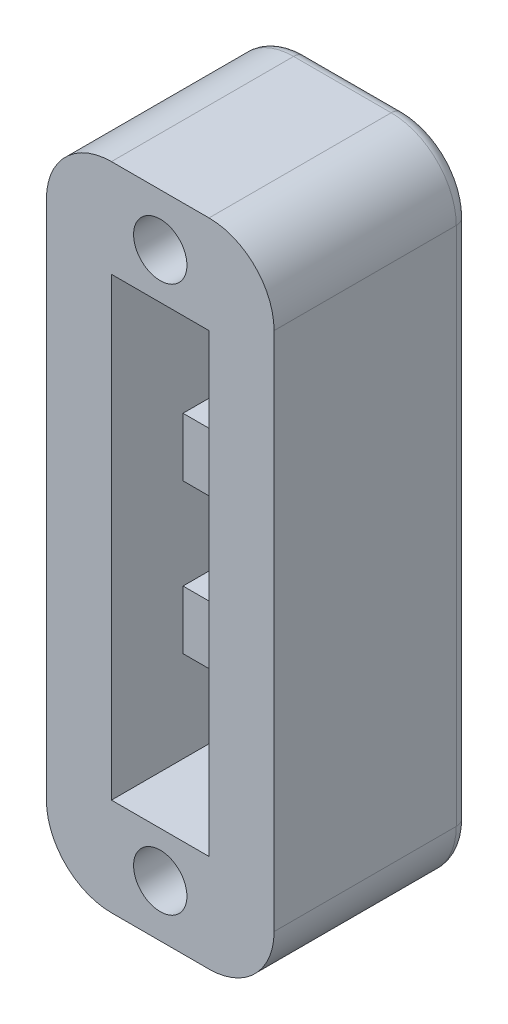
ISO-10303-21;
HEADER;
FILE_DESCRIPTION(('STEP AP214'),'2;1');
FILE_NAME('part.step','',(''),(''),'','','');
FILE_SCHEMA(('AUTOMOTIVE_DESIGN { 1 0 10303 214 1 1 1 1 }'));
ENDSEC;
DATA;
#1=APPLICATION_CONTEXT('core data for automotive mechanical design processes');
#2=APPLICATION_PROTOCOL_DEFINITION('international standard','automotive_design',2000,#1);
#3=PRODUCT_CONTEXT('',#1,'mechanical');
#4=PRODUCT('Part','Part','',(#3));
#5=PRODUCT_RELATED_PRODUCT_CATEGORY('part','',(#4));
#6=PRODUCT_DEFINITION_FORMATION('','',#4);
#7=PRODUCT_DEFINITION_CONTEXT('part definition',#1,'design');
#8=PRODUCT_DEFINITION('design','',#6,#7);
#9=PRODUCT_DEFINITION_SHAPE('','',#8);
#10=(LENGTH_UNIT() NAMED_UNIT(*) SI_UNIT(.MILLI.,.METRE.));
#11=(NAMED_UNIT(*) PLANE_ANGLE_UNIT() SI_UNIT($,.RADIAN.));
#12=(NAMED_UNIT(*) SI_UNIT($,.STERADIAN.) SOLID_ANGLE_UNIT());
#13=UNCERTAINTY_MEASURE_WITH_UNIT(LENGTH_MEASURE(1.E-05),#10,'distance_accuracy_value','');
#14=(GEOMETRIC_REPRESENTATION_CONTEXT(3) GLOBAL_UNCERTAINTY_ASSIGNED_CONTEXT((#13)) GLOBAL_UNIT_ASSIGNED_CONTEXT((#10,
#11,#12)) REPRESENTATION_CONTEXT('',''));
#15=CARTESIAN_POINT('',(0.,0.,0.));
#16=DIRECTION('',(0.,0.,1.));
#17=DIRECTION('',(1.,0.,0.));
#18=AXIS2_PLACEMENT_3D('',#15,#16,#17);
#19=CARTESIAN_POINT('',(-1.905,3.81,-21.993632750361));
#20=DIRECTION('',(-1.,0.,0.));
#21=DIRECTION('',(0.,0.,1.));
#22=AXIS2_PLACEMENT_3D('',#19,#20,#21);
#23=PLANE('',#22);
#24=DIRECTION('',(0.,0.,1.));
#25=VECTOR('',#24,1.);
#26=CARTESIAN_POINT('',(-1.905,19.05,-1.524));
#27=LINE('',#26,#25);
#28=CARTESIAN_POINT('',(-1.905,19.05,-1.524));
#29=VERTEX_POINT('',#28);
#30=CARTESIAN_POINT('',(-1.905,19.05,1.016));
#31=VERTEX_POINT('',#30);
#32=EDGE_CURVE('E268',#29,#31,#27,.T.);
#33=ORIENTED_EDGE('',*,*,#32,.T.);
#34=DIRECTION('',(0.,1.,0.));
#35=VECTOR('',#34,1.);
#36=CARTESIAN_POINT('',(-1.905,19.05,1.016));
#37=LINE('',#36,#35);
#38=CARTESIAN_POINT('',(-1.905,21.59,1.016));
#39=VERTEX_POINT('',#38);
#40=EDGE_CURVE('E264',#31,#39,#37,.T.);
#41=ORIENTED_EDGE('',*,*,#40,.T.);
#42=DIRECTION('',(0.,0.,1.));
#43=VECTOR('',#42,1.);
#44=CARTESIAN_POINT('',(-1.905,21.59,-21.993632750361));
#45=LINE('',#44,#43);
#46=CARTESIAN_POINT('',(-1.905,21.59,3.81));
#47=VERTEX_POINT('',#46);
#48=EDGE_CURVE('E344',#39,#47,#45,.T.);
#49=ORIENTED_EDGE('',*,*,#48,.T.);
#50=DIRECTION('',(0.,-1.,0.));
#51=VECTOR('',#50,1.);
#52=CARTESIAN_POINT('',(-1.905,3.81,3.81));
#53=LINE('',#52,#51);
#54=CARTESIAN_POINT('',(-1.905,3.81,3.81));
#55=VERTEX_POINT('',#54);
#56=EDGE_CURVE('E226',#47,#55,#53,.T.);
#57=ORIENTED_EDGE('',*,*,#56,.T.);
#58=DIRECTION('',(0.,0.,1.));
#59=VECTOR('',#58,1.);
#60=CARTESIAN_POINT('',(-1.905,3.81,-21.993632750361));
#61=LINE('',#60,#59);
#62=CARTESIAN_POINT('',(-1.905,3.81,-3.81));
#63=VERTEX_POINT('',#62);
#64=EDGE_CURVE('E219',#63,#55,#61,.T.);
#65=ORIENTED_EDGE('',*,*,#64,.F.);
#66=DIRECTION('',(0.,-1.,0.));
#67=VECTOR('',#66,1.);
#68=CARTESIAN_POINT('',(-1.905,7.366,-3.81));
#69=LINE('',#68,#67);
#70=CARTESIAN_POINT('',(-1.905,7.366,-3.81));
#71=VERTEX_POINT('',#70);
#72=EDGE_CURVE('E223',#71,#63,#69,.T.);
#73=ORIENTED_EDGE('',*,*,#72,.F.);
#74=DIRECTION('',(0.,0.,1.));
#75=VECTOR('',#74,1.);
#76=CARTESIAN_POINT('',(-1.905,7.366,-1.524));
#77=LINE('',#76,#75);
#78=CARTESIAN_POINT('',(-1.905,7.366,1.016));
#79=VERTEX_POINT('',#78);
#80=EDGE_CURVE('E292',#71,#79,#77,.T.);
#81=ORIENTED_EDGE('',*,*,#80,.T.);
#82=DIRECTION('',(0.,1.,0.));
#83=VECTOR('',#82,1.);
#84=CARTESIAN_POINT('',(-1.905,9.652,1.016));
#85=LINE('',#84,#83);
#86=CARTESIAN_POINT('',(-1.905,9.652,1.016));
#87=VERTEX_POINT('',#86);
#88=EDGE_CURVE('E288',#79,#87,#85,.T.);
#89=ORIENTED_EDGE('',*,*,#88,.T.);
#90=DIRECTION('',(0.,0.,-1.));
#91=VECTOR('',#90,1.);
#92=CARTESIAN_POINT('',(-1.905,9.652,-1.524));
#93=LINE('',#92,#91);
#94=CARTESIAN_POINT('',(-1.905,9.652,-1.524));
#95=VERTEX_POINT('',#94);
#96=EDGE_CURVE('E277',#87,#95,#93,.T.);
#97=ORIENTED_EDGE('',*,*,#96,.T.);
#98=DIRECTION('',(0.,1.,0.));
#99=VECTOR('',#98,1.);
#100=CARTESIAN_POINT('',(-1.905,3.81,-1.524));
#101=LINE('',#100,#99);
#102=CARTESIAN_POINT('',(-1.905,13.208,-1.524));
#103=VERTEX_POINT('',#102);
#104=EDGE_CURVE('E331',#95,#103,#101,.T.);
#105=ORIENTED_EDGE('',*,*,#104,.T.);
#106=DIRECTION('',(0.,0.,1.));
#107=VECTOR('',#106,1.);
#108=CARTESIAN_POINT('',(-1.905,13.208,-1.524));
#109=LINE('',#108,#107);
#110=CARTESIAN_POINT('',(-1.905,13.208,1.016));
#111=VERTEX_POINT('',#110);
#112=EDGE_CURVE('E317',#103,#111,#109,.T.);
#113=ORIENTED_EDGE('',*,*,#112,.T.);
#114=DIRECTION('',(0.,1.,0.));
#115=VECTOR('',#114,1.);
#116=CARTESIAN_POINT('',(-1.905,15.494,1.016));
#117=LINE('',#116,#115);
#118=CARTESIAN_POINT('',(-1.905,15.494,1.016));
#119=VERTEX_POINT('',#118);
#120=EDGE_CURVE('E314',#111,#119,#117,.T.);
#121=ORIENTED_EDGE('',*,*,#120,.T.);
#122=DIRECTION('',(0.,0.,-1.));
#123=VECTOR('',#122,1.);
#124=CARTESIAN_POINT('',(-1.905,15.494,-1.524));
#125=LINE('',#124,#123);
#126=CARTESIAN_POINT('',(-1.905,15.494,-1.524));
#127=VERTEX_POINT('',#126);
#128=EDGE_CURVE('E304',#119,#127,#125,.T.);
#129=ORIENTED_EDGE('',*,*,#128,.T.);
#130=EDGE_CURVE('E329',#127,#29,#101,.T.);
#131=ORIENTED_EDGE('',*,*,#130,.T.);
#132=EDGE_LOOP('',(#33,#41,#49,#57,#65,#73,#81,#89,#97,#105,#113,#121,#129,#131));
#133=FACE_BOUND('',#132,.T.);
#134=ADVANCED_FACE('F44',(#133),#23,.F.);
#135=CARTESIAN_POINT('',(1.905,3.81,-21.993632750361));
#136=DIRECTION('',(1.,0.,0.));
#137=DIRECTION('',(0.,0.,-1.));
#138=AXIS2_PLACEMENT_3D('',#135,#136,#137);
#139=PLANE('',#138);
#140=DIRECTION('',(0.,0.,1.));
#141=VECTOR('',#140,1.);
#142=CARTESIAN_POINT('',(1.905,19.05,-1.524));
#143=LINE('',#142,#141);
#144=CARTESIAN_POINT('',(1.905,19.05,-1.524));
#145=VERTEX_POINT('',#144);
#146=CARTESIAN_POINT('',(1.905,19.05,1.016));
#147=VERTEX_POINT('',#146);
#148=EDGE_CURVE('E261',#145,#147,#143,.T.);
#149=ORIENTED_EDGE('',*,*,#148,.F.);
#150=DIRECTION('',(0.,-1.,0.));
#151=VECTOR('',#150,1.);
#152=CARTESIAN_POINT('',(1.905,3.81,-1.524));
#153=LINE('',#152,#151);
#154=CARTESIAN_POINT('',(1.905,15.494,-1.524));
#155=VERTEX_POINT('',#154);
#156=EDGE_CURVE('E327',#145,#155,#153,.T.);
#157=ORIENTED_EDGE('',*,*,#156,.T.);
#158=DIRECTION('',(0.,0.,-1.));
#159=VECTOR('',#158,1.);
#160=CARTESIAN_POINT('',(1.905,15.494,-1.524));
#161=LINE('',#160,#159);
#162=CARTESIAN_POINT('',(1.905,15.494,1.016));
#163=VERTEX_POINT('',#162);
#164=EDGE_CURVE('E301',#163,#155,#161,.T.);
#165=ORIENTED_EDGE('',*,*,#164,.F.);
#166=DIRECTION('',(0.,1.,0.));
#167=VECTOR('',#166,1.);
#168=CARTESIAN_POINT('',(1.905,15.494,1.016));
#169=LINE('',#168,#167);
#170=CARTESIAN_POINT('',(1.905,13.208,1.016));
#171=VERTEX_POINT('',#170);
#172=EDGE_CURVE('E306',#171,#163,#169,.T.);
#173=ORIENTED_EDGE('',*,*,#172,.F.);
#174=DIRECTION('',(0.,0.,1.));
#175=VECTOR('',#174,1.);
#176=CARTESIAN_POINT('',(1.905,13.208,-1.524));
#177=LINE('',#176,#175);
#178=CARTESIAN_POINT('',(1.905,13.208,-1.524));
#179=VERTEX_POINT('',#178);
#180=EDGE_CURVE('E310',#179,#171,#177,.T.);
#181=ORIENTED_EDGE('',*,*,#180,.F.);
#182=CARTESIAN_POINT('',(1.905,9.652,-1.524));
#183=VERTEX_POINT('',#182);
#184=EDGE_CURVE('E330',#179,#183,#153,.T.);
#185=ORIENTED_EDGE('',*,*,#184,.T.);
#186=DIRECTION('',(0.,0.,-1.));
#187=VECTOR('',#186,1.);
#188=CARTESIAN_POINT('',(1.905,9.652,-1.524));
#189=LINE('',#188,#187);
#190=CARTESIAN_POINT('',(1.905,9.652,1.016));
#191=VERTEX_POINT('',#190);
#192=EDGE_CURVE('E275',#191,#183,#189,.T.);
#193=ORIENTED_EDGE('',*,*,#192,.F.);
#194=DIRECTION('',(0.,1.,0.));
#195=VECTOR('',#194,1.);
#196=CARTESIAN_POINT('',(1.905,9.652,1.016));
#197=LINE('',#196,#195);
#198=CARTESIAN_POINT('',(1.905,7.366,1.016));
#199=VERTEX_POINT('',#198);
#200=EDGE_CURVE('E279',#199,#191,#197,.T.);
#201=ORIENTED_EDGE('',*,*,#200,.F.);
#202=DIRECTION('',(0.,0.,1.));
#203=VECTOR('',#202,1.);
#204=CARTESIAN_POINT('',(1.905,7.366,-1.524));
#205=LINE('',#204,#203);
#206=CARTESIAN_POINT('',(1.905,7.366,-3.81));
#207=VERTEX_POINT('',#206);
#208=EDGE_CURVE('E284',#207,#199,#205,.T.);
#209=ORIENTED_EDGE('',*,*,#208,.F.);
#210=DIRECTION('',(0.,1.,0.));
#211=VECTOR('',#210,1.);
#212=CARTESIAN_POINT('',(1.905,7.366,-3.81));
#213=LINE('',#212,#211);
#214=CARTESIAN_POINT('',(1.905,3.81,-3.81));
#215=VERTEX_POINT('',#214);
#216=EDGE_CURVE('E239',#215,#207,#213,.T.);
#217=ORIENTED_EDGE('',*,*,#216,.F.);
#218=DIRECTION('',(0.,0.,1.));
#219=VECTOR('',#218,1.);
#220=CARTESIAN_POINT('',(1.905,3.81,-21.993632750361));
#221=LINE('',#220,#219);
#222=CARTESIAN_POINT('',(1.905,3.81,3.81));
#223=VERTEX_POINT('',#222);
#224=EDGE_CURVE('E230',#215,#223,#221,.T.);
#225=ORIENTED_EDGE('',*,*,#224,.T.);
#226=DIRECTION('',(0.,1.,0.));
#227=VECTOR('',#226,1.);
#228=CARTESIAN_POINT('',(1.905,3.81,3.81));
#229=LINE('',#228,#227);
#230=CARTESIAN_POINT('',(1.905,21.59,3.81));
#231=VERTEX_POINT('',#230);
#232=EDGE_CURVE('E338',#223,#231,#229,.T.);
#233=ORIENTED_EDGE('',*,*,#232,.T.);
#234=DIRECTION('',(0.,0.,1.));
#235=VECTOR('',#234,1.);
#236=CARTESIAN_POINT('',(1.905,21.59,-21.993632750361));
#237=LINE('',#236,#235);
#238=CARTESIAN_POINT('',(1.905,21.59,1.01599999999999));
#239=VERTEX_POINT('',#238);
#240=EDGE_CURVE('E346',#239,#231,#237,.T.);
#241=ORIENTED_EDGE('',*,*,#240,.F.);
#242=DIRECTION('',(0.,1.,0.));
#243=VECTOR('',#242,1.);
#244=CARTESIAN_POINT('',(1.905,19.05,1.016));
#245=LINE('',#244,#243);
#246=EDGE_CURVE('E256',#147,#239,#245,.T.);
#247=ORIENTED_EDGE('',*,*,#246,.F.);
#248=EDGE_LOOP('',(#149,#157,#165,#173,#181,#185,#193,#201,#209,#217,#225,#233,#241,#247));
#249=FACE_BOUND('',#248,.T.);
#250=ADVANCED_FACE('F537',(#249),#139,.F.);
#251=CARTESIAN_POINT('',(-4.445,25.4,-1.524));
#252=DIRECTION('',(0.,0.,1.));
#253=DIRECTION('',(1.,0.,0.));
#254=AXIS2_PLACEMENT_3D('',#251,#252,#253);
#255=PLANE('',#254);
#256=ORIENTED_EDGE('',*,*,#156,.F.);
#257=DIRECTION('',(1.,0.,0.));
#258=VECTOR('',#257,1.);
#259=CARTESIAN_POINT('',(-5.49710244842766,19.05,-1.524));
#260=LINE('',#259,#258);
#261=EDGE_CURVE('E255',#29,#145,#260,.T.);
#262=ORIENTED_EDGE('',*,*,#261,.F.);
#263=ORIENTED_EDGE('',*,*,#130,.F.);
#264=DIRECTION('',(1.,0.,0.));
#265=VECTOR('',#264,1.);
#266=CARTESIAN_POINT('',(-5.49710244842766,15.494,-1.524));
#267=LINE('',#266,#265);
#268=EDGE_CURVE('E291',#127,#155,#267,.T.);
#269=ORIENTED_EDGE('',*,*,#268,.T.);
#270=EDGE_LOOP('',(#256,#262,#263,#269));
#271=FACE_BOUND('',#270,.T.);
#272=ADVANCED_FACE('F542',(#271),#255,.T.);
#273=CARTESIAN_POINT('',(-1.905,21.59,-21.993632750361));
#274=DIRECTION('',(0.,1.,0.));
#275=DIRECTION('',(0.,0.,1.));
#276=AXIS2_PLACEMENT_3D('',#273,#274,#275);
#277=PLANE('',#276);
#278=DIRECTION('',(1.,0.,0.));
#279=VECTOR('',#278,1.);
#280=CARTESIAN_POINT('',(-5.49710244842766,21.59,1.016));
#281=LINE('',#280,#279);
#282=EDGE_CURVE('E259',#39,#239,#281,.T.);
#283=ORIENTED_EDGE('',*,*,#282,.T.);
#284=ORIENTED_EDGE('',*,*,#240,.T.);
#285=DIRECTION('',(-1.,0.,0.));
#286=VECTOR('',#285,1.);
#287=CARTESIAN_POINT('',(-1.905,21.59,3.81));
#288=LINE('',#287,#286);
#289=EDGE_CURVE('E231',#231,#47,#288,.T.);
#290=ORIENTED_EDGE('',*,*,#289,.T.);
#291=ORIENTED_EDGE('',*,*,#48,.F.);
#292=EDGE_LOOP('',(#283,#284,#290,#291));
#293=FACE_BOUND('',#292,.T.);
#294=ADVANCED_FACE('F806',(#293),#277,.F.);
#295=ORIENTED_EDGE('',*,*,#104,.F.);
#296=DIRECTION('',(1.,0.,0.));
#297=VECTOR('',#296,1.);
#298=CARTESIAN_POINT('',(-5.49710244842766,9.652,-1.524));
#299=LINE('',#298,#297);
#300=EDGE_CURVE('E267',#95,#183,#299,.T.);
#301=ORIENTED_EDGE('',*,*,#300,.T.);
#302=ORIENTED_EDGE('',*,*,#184,.F.);
#303=DIRECTION('',(1.,0.,0.));
#304=VECTOR('',#303,1.);
#305=CARTESIAN_POINT('',(-5.49710244842766,13.208,-1.524));
#306=LINE('',#305,#304);
#307=EDGE_CURVE('E313',#103,#179,#306,.T.);
#308=ORIENTED_EDGE('',*,*,#307,.F.);
#309=EDGE_LOOP('',(#295,#301,#302,#308));
#310=FACE_BOUND('',#309,.T.);
#311=ADVANCED_FACE('F556',(#310),#255,.T.);
#312=CARTESIAN_POINT('',(4.445,25.4,3.81));
#313=DIRECTION('',(-1.,0.,0.));
#314=DIRECTION('',(0.,0.,1.));
#315=AXIS2_PLACEMENT_3D('',#312,#313,#314);
#316=PLANE('',#315);
#317=DIRECTION('',(0.,0.,-1.));
#318=VECTOR('',#317,1.);
#319=CARTESIAN_POINT('',(4.445,2.54,-3.81));
#320=LINE('',#319,#318);
#321=CARTESIAN_POINT('',(4.445,2.54,3.81));
#322=VERTEX_POINT('',#321);
#323=CARTESIAN_POINT('',(4.445,2.54,-3.302));
#324=VERTEX_POINT('',#323);
#325=EDGE_CURVE('E382',#322,#324,#320,.T.);
#326=ORIENTED_EDGE('',*,*,#325,.T.);
#327=DIRECTION('',(0.,-1.,0.));
#328=VECTOR('',#327,1.);
#329=CARTESIAN_POINT('',(4.445,25.4,-3.302));
#330=LINE('',#329,#328);
#331=CARTESIAN_POINT('',(4.445,22.86,-3.302));
#332=VERTEX_POINT('',#331);
#333=EDGE_CURVE('E411',#324,#332,#330,.F.);
#334=ORIENTED_EDGE('',*,*,#333,.T.);
#335=DIRECTION('',(0.,0.,-1.));
#336=VECTOR('',#335,1.);
#337=CARTESIAN_POINT('',(4.445,22.86,3.81));
#338=LINE('',#337,#336);
#339=CARTESIAN_POINT('',(4.445,22.86,3.81));
#340=VERTEX_POINT('',#339);
#341=EDGE_CURVE('E380',#332,#340,#338,.F.);
#342=ORIENTED_EDGE('',*,*,#341,.T.);
#343=DIRECTION('',(0.,-1.,0.));
#344=VECTOR('',#343,1.);
#345=CARTESIAN_POINT('',(4.445,25.4,3.81));
#346=LINE('',#345,#344);
#347=EDGE_CURVE('E353',#340,#322,#346,.T.);
#348=ORIENTED_EDGE('',*,*,#347,.T.);
#349=EDGE_LOOP('',(#326,#334,#342,#348));
#350=FACE_BOUND('',#349,.T.);
#351=ADVANCED_FACE('F525',(#350),#316,.F.);
#352=CARTESIAN_POINT('',(-4.445,25.4,-3.81));
#353=DIRECTION('',(0.,0.,1.));
#354=DIRECTION('',(1.,0.,0.));
#355=AXIS2_PLACEMENT_3D('',#352,#353,#354);
#356=PLANE('',#355);
#357=DIRECTION('',(-1.,0.,0.));
#358=VECTOR('',#357,1.);
#359=CARTESIAN_POINT('',(-4.445,24.892,-3.81));
#360=LINE('',#359,#358);
#361=CARTESIAN_POINT('',(-1.905,24.892,-3.81));
#362=VERTEX_POINT('',#361);
#363=CARTESIAN_POINT('',(1.905,24.892,-3.81));
#364=VERTEX_POINT('',#363);
#365=EDGE_CURVE('E390',#362,#364,#360,.F.);
#366=ORIENTED_EDGE('',*,*,#365,.T.);
#367=CARTESIAN_POINT('',(1.905,22.86,-3.81));
#368=DIRECTION('',(0.,0.,1.));
#369=DIRECTION('',(1.,0.,0.));
#370=AXIS2_PLACEMENT_3D('',#367,#368,#369);
#371=CIRCLE('',#370,2.032);
#372=CARTESIAN_POINT('',(3.937,22.86,-3.81));
#373=VERTEX_POINT('',#372);
#374=EDGE_CURVE('E405',#364,#373,#371,.F.);
#375=ORIENTED_EDGE('',*,*,#374,.T.);
#376=DIRECTION('',(0.,-1.,0.));
#377=VECTOR('',#376,1.);
#378=CARTESIAN_POINT('',(3.937,25.4,-3.81));
#379=LINE('',#378,#377);
#380=CARTESIAN_POINT('',(3.937,2.54,-3.81));
#381=VERTEX_POINT('',#380);
#382=EDGE_CURVE('E402',#373,#381,#379,.T.);
#383=ORIENTED_EDGE('',*,*,#382,.T.);
#384=CARTESIAN_POINT('',(1.905,2.54,-3.81));
#385=DIRECTION('',(0.,0.,1.));
#386=DIRECTION('',(1.,0.,0.));
#387=AXIS2_PLACEMENT_3D('',#384,#385,#386);
#388=CIRCLE('',#387,2.032);
#389=CARTESIAN_POINT('',(1.905,0.508000000000002,-3.81));
#390=VERTEX_POINT('',#389);
#391=EDGE_CURVE('E400',#381,#390,#388,.F.);
#392=ORIENTED_EDGE('',*,*,#391,.T.);
#393=DIRECTION('',(-1.,0.,0.));
#394=VECTOR('',#393,1.);
#395=CARTESIAN_POINT('',(-1.905,0.508000000000002,-3.81));
#396=LINE('',#395,#394);
#397=CARTESIAN_POINT('',(-1.905,0.508000000000001,-3.81));
#398=VERTEX_POINT('',#397);
#399=EDGE_CURVE('E398',#390,#398,#396,.T.);
#400=ORIENTED_EDGE('',*,*,#399,.T.);
#401=CARTESIAN_POINT('',(-1.905,2.54,-3.81));
#402=DIRECTION('',(0.,0.,1.));
#403=DIRECTION('',(1.,0.,0.));
#404=AXIS2_PLACEMENT_3D('',#401,#402,#403);
#405=CIRCLE('',#404,2.032);
#406=CARTESIAN_POINT('',(-3.937,2.54,-3.81));
#407=VERTEX_POINT('',#406);
#408=EDGE_CURVE('E396',#398,#407,#405,.F.);
#409=ORIENTED_EDGE('',*,*,#408,.T.);
#410=DIRECTION('',(0.,-1.,0.));
#411=VECTOR('',#410,1.);
#412=CARTESIAN_POINT('',(-3.937,25.4,-3.81));
#413=LINE('',#412,#411);
#414=CARTESIAN_POINT('',(-3.937,22.86,-3.81));
#415=VERTEX_POINT('',#414);
#416=EDGE_CURVE('E394',#407,#415,#413,.F.);
#417=ORIENTED_EDGE('',*,*,#416,.T.);
#418=CARTESIAN_POINT('',(-1.905,22.86,-3.81));
#419=DIRECTION('',(0.,0.,1.));
#420=DIRECTION('',(1.,0.,0.));
#421=AXIS2_PLACEMENT_3D('',#418,#419,#420);
#422=CIRCLE('',#421,2.032);
#423=EDGE_CURVE('E392',#415,#362,#422,.F.);
#424=ORIENTED_EDGE('',*,*,#423,.T.);
#425=EDGE_LOOP('',(#366,#375,#383,#392,#400,#409,#417,#424));
#426=FACE_BOUND('',#425,.T.);
#427=CARTESIAN_POINT('',(0.,23.368,-3.81));
#428=DIRECTION('',(0.,0.,1.));
#429=DIRECTION('',(1.,0.,0.));
#430=AXIS2_PLACEMENT_3D('',#427,#428,#429);
#431=CIRCLE('',#430,1.0414);
#432=CARTESIAN_POINT('',(1.0414,23.368,-3.81));
#433=VERTEX_POINT('',#432);
#434=EDGE_CURVE('E244',#433,#433,#431,.T.);
#435=ORIENTED_EDGE('',*,*,#434,.T.);
#436=EDGE_LOOP('',(#435));
#437=FACE_BOUND('',#436,.T.);
#438=CARTESIAN_POINT('',(0.,2.032,-3.81));
#439=DIRECTION('',(0.,0.,1.));
#440=DIRECTION('',(1.,0.,0.));
#441=AXIS2_PLACEMENT_3D('',#438,#439,#440);
#442=CIRCLE('',#441,1.0414);
#443=CARTESIAN_POINT('',(1.0414,2.032,-3.81));
#444=VERTEX_POINT('',#443);
#445=EDGE_CURVE('E450',#444,#444,#442,.T.);
#446=ORIENTED_EDGE('',*,*,#445,.T.);
#447=EDGE_LOOP('',(#446));
#448=FACE_BOUND('',#447,.T.);
#449=DIRECTION('',(-1.,0.,0.));
#450=VECTOR('',#449,1.);
#451=CARTESIAN_POINT('',(-1.905,7.366,-3.81));
#452=LINE('',#451,#450);
#453=EDGE_CURVE('E243',#207,#71,#452,.T.);
#454=ORIENTED_EDGE('',*,*,#453,.T.);
#455=ORIENTED_EDGE('',*,*,#72,.T.);
#456=DIRECTION('',(1.,0.,0.));
#457=VECTOR('',#456,1.);
#458=CARTESIAN_POINT('',(-1.905,3.81,-3.81));
#459=LINE('',#458,#457);
#460=EDGE_CURVE('E234',#63,#215,#459,.T.);
#461=ORIENTED_EDGE('',*,*,#460,.T.);
#462=ORIENTED_EDGE('',*,*,#216,.T.);
#463=EDGE_LOOP('',(#454,#455,#461,#462));
#464=FACE_BOUND('',#463,.T.);
#465=ADVANCED_FACE('F241',(#426,#437,#448,#464),#356,.F.);
#466=CARTESIAN_POINT('',(-4.445,25.4,3.81));
#467=DIRECTION('',(1.,0.,0.));
#468=DIRECTION('',(0.,0.,-1.));
#469=AXIS2_PLACEMENT_3D('',#466,#467,#468);
#470=PLANE('',#469);
#471=DIRECTION('',(0.,0.,1.));
#472=VECTOR('',#471,1.);
#473=CARTESIAN_POINT('',(-4.445,22.86,3.81));
#474=LINE('',#473,#472);
#475=CARTESIAN_POINT('',(-4.445,22.86,3.81));
#476=VERTEX_POINT('',#475);
#477=CARTESIAN_POINT('',(-4.445,22.86,-3.302));
#478=VERTEX_POINT('',#477);
#479=EDGE_CURVE('E363',#476,#478,#474,.F.);
#480=ORIENTED_EDGE('',*,*,#479,.T.);
#481=DIRECTION('',(0.,-1.,0.));
#482=VECTOR('',#481,1.);
#483=CARTESIAN_POINT('',(-4.445,25.4,-3.302));
#484=LINE('',#483,#482);
#485=CARTESIAN_POINT('',(-4.445,2.54,-3.302));
#486=VERTEX_POINT('',#485);
#487=EDGE_CURVE('E420',#478,#486,#484,.T.);
#488=ORIENTED_EDGE('',*,*,#487,.T.);
#489=DIRECTION('',(0.,0.,1.));
#490=VECTOR('',#489,1.);
#491=CARTESIAN_POINT('',(-4.445,2.54,3.81));
#492=LINE('',#491,#490);
#493=CARTESIAN_POINT('',(-4.445,2.54,3.81));
#494=VERTEX_POINT('',#493);
#495=EDGE_CURVE('E365',#486,#494,#492,.T.);
#496=ORIENTED_EDGE('',*,*,#495,.T.);
#497=DIRECTION('',(0.,-1.,0.));
#498=VECTOR('',#497,1.);
#499=CARTESIAN_POINT('',(-4.445,25.4,3.81));
#500=LINE('',#499,#498);
#501=EDGE_CURVE('E359',#476,#494,#500,.T.);
#502=ORIENTED_EDGE('',*,*,#501,.F.);
#503=EDGE_LOOP('',(#480,#488,#496,#502));
#504=FACE_BOUND('',#503,.T.);
#505=ADVANCED_FACE('F466',(#504),#470,.F.);
#506=CARTESIAN_POINT('',(-4.445,25.4,3.81));
#507=DIRECTION('',(0.,0.,-1.));
#508=DIRECTION('',(-1.,0.,0.));
#509=AXIS2_PLACEMENT_3D('',#506,#507,#508);
#510=PLANE('',#509);
#511=CARTESIAN_POINT('',(0.,23.368,3.81));
#512=DIRECTION('',(0.,0.,1.));
#513=DIRECTION('',(1.,0.,0.));
#514=AXIS2_PLACEMENT_3D('',#511,#512,#513);
#515=CIRCLE('',#514,1.0414);
#516=CARTESIAN_POINT('',(1.0414,23.368,3.81));
#517=VERTEX_POINT('',#516);
#518=EDGE_CURVE('E247',#517,#517,#515,.T.);
#519=ORIENTED_EDGE('',*,*,#518,.F.);
#520=EDGE_LOOP('',(#519));
#521=FACE_BOUND('',#520,.T.);
#522=CARTESIAN_POINT('',(0.,2.032,3.81));
#523=DIRECTION('',(0.,0.,1.));
#524=DIRECTION('',(1.,0.,0.));
#525=AXIS2_PLACEMENT_3D('',#522,#523,#524);
#526=CIRCLE('',#525,1.0414);
#527=CARTESIAN_POINT('',(1.0414,2.032,3.81));
#528=VERTEX_POINT('',#527);
#529=EDGE_CURVE('E250',#528,#528,#526,.T.);
#530=ORIENTED_EDGE('',*,*,#529,.F.);
#531=EDGE_LOOP('',(#530));
#532=FACE_BOUND('',#531,.T.);
#533=DIRECTION('',(1.,0.,0.));
#534=VECTOR('',#533,1.);
#535=CARTESIAN_POINT('',(-1.905,3.81,3.81));
#536=LINE('',#535,#534);
#537=EDGE_CURVE('E336',#55,#223,#536,.T.);
#538=ORIENTED_EDGE('',*,*,#537,.F.);
#539=ORIENTED_EDGE('',*,*,#56,.F.);
#540=ORIENTED_EDGE('',*,*,#289,.F.);
#541=ORIENTED_EDGE('',*,*,#232,.F.);
#542=EDGE_LOOP('',(#538,#539,#540,#541));
#543=FACE_BOUND('',#542,.T.);
#544=ORIENTED_EDGE('',*,*,#501,.T.);
#545=CARTESIAN_POINT('',(-1.905,2.54,3.81));
#546=DIRECTION('',(0.,0.,-1.));
#547=DIRECTION('',(-1.,0.,0.));
#548=AXIS2_PLACEMENT_3D('',#545,#546,#547);
#549=CIRCLE('',#548,2.54);
#550=CARTESIAN_POINT('',(-1.905,0.,3.81));
#551=VERTEX_POINT('',#550);
#552=EDGE_CURVE('E373',#494,#551,#549,.F.);
#553=ORIENTED_EDGE('',*,*,#552,.T.);
#554=DIRECTION('',(1.,0.,0.));
#555=VECTOR('',#554,1.);
#556=CARTESIAN_POINT('',(-4.445,0.,3.81));
#557=LINE('',#556,#555);
#558=CARTESIAN_POINT('',(1.905,0.,3.81));
#559=VERTEX_POINT('',#558);
#560=EDGE_CURVE('E333',#551,#559,#557,.T.);
#561=ORIENTED_EDGE('',*,*,#560,.T.);
#562=CARTESIAN_POINT('',(1.905,2.54,3.81));
#563=DIRECTION('',(0.,0.,-1.));
#564=DIRECTION('',(-1.,0.,0.));
#565=AXIS2_PLACEMENT_3D('',#562,#563,#564);
#566=CIRCLE('',#565,2.54);
#567=EDGE_CURVE('E371',#559,#322,#566,.F.);
#568=ORIENTED_EDGE('',*,*,#567,.T.);
#569=ORIENTED_EDGE('',*,*,#347,.F.);
#570=CARTESIAN_POINT('',(1.905,22.86,3.81));
#571=DIRECTION('',(0.,0.,-1.));
#572=DIRECTION('',(-1.,0.,0.));
#573=AXIS2_PLACEMENT_3D('',#570,#571,#572);
#574=CIRCLE('',#573,2.54);
#575=CARTESIAN_POINT('',(1.905,25.4,3.81));
#576=VERTEX_POINT('',#575);
#577=EDGE_CURVE('E369',#340,#576,#574,.F.);
#578=ORIENTED_EDGE('',*,*,#577,.T.);
#579=DIRECTION('',(1.,0.,0.));
#580=VECTOR('',#579,1.);
#581=CARTESIAN_POINT('',(-4.445,25.4,3.81));
#582=LINE('',#581,#580);
#583=CARTESIAN_POINT('',(-1.905,25.4,3.81));
#584=VERTEX_POINT('',#583);
#585=EDGE_CURVE('E349',#584,#576,#582,.T.);
#586=ORIENTED_EDGE('',*,*,#585,.F.);
#587=CARTESIAN_POINT('',(-1.905,22.86,3.81));
#588=DIRECTION('',(0.,0.,-1.));
#589=DIRECTION('',(-1.,0.,0.));
#590=AXIS2_PLACEMENT_3D('',#587,#588,#589);
#591=CIRCLE('',#590,2.54);
#592=EDGE_CURVE('E367',#584,#476,#591,.F.);
#593=ORIENTED_EDGE('',*,*,#592,.T.);
#594=EDGE_LOOP('',(#544,#553,#561,#568,#569,#578,#586,#593));
#595=FACE_BOUND('',#594,.T.);
#596=ADVANCED_FACE('F462',(#521,#532,#543,#595),#510,.F.);
#597=CARTESIAN_POINT('',(0.,25.4,0.));
#598=DIRECTION('',(0.,-1.,0.));
#599=DIRECTION('',(0.,0.,-1.));
#600=AXIS2_PLACEMENT_3D('',#597,#598,#599);
#601=PLANE('',#600);
#602=DIRECTION('',(0.,0.,-1.));
#603=VECTOR('',#602,1.);
#604=CARTESIAN_POINT('',(1.905,25.4,0.));
#605=LINE('',#604,#603);
#606=CARTESIAN_POINT('',(1.905,25.4,-3.302));
#607=VERTEX_POINT('',#606);
#608=EDGE_CURVE('E388',#576,#607,#605,.T.);
#609=ORIENTED_EDGE('',*,*,#608,.T.);
#610=DIRECTION('',(-1.,0.,0.));
#611=VECTOR('',#610,1.);
#612=CARTESIAN_POINT('',(0.,25.4,-3.302));
#613=LINE('',#612,#611);
#614=CARTESIAN_POINT('',(-1.905,25.4,-3.302));
#615=VERTEX_POINT('',#614);
#616=EDGE_CURVE('E12',#607,#615,#613,.T.);
#617=ORIENTED_EDGE('',*,*,#616,.T.);
#618=DIRECTION('',(0.,0.,1.));
#619=VECTOR('',#618,1.);
#620=CARTESIAN_POINT('',(-1.905,25.4,0.));
#621=LINE('',#620,#619);
#622=EDGE_CURVE('E386',#615,#584,#621,.T.);
#623=ORIENTED_EDGE('',*,*,#622,.T.);
#624=ORIENTED_EDGE('',*,*,#585,.T.);
#625=EDGE_LOOP('',(#609,#617,#623,#624));
#626=FACE_BOUND('',#625,.T.);
#627=ADVANCED_FACE('F465',(#626),#601,.F.);
#628=CARTESIAN_POINT('',(0.,0.,0.));
#629=DIRECTION('',(0.,-1.,0.));
#630=DIRECTION('',(0.,0.,-1.));
#631=AXIS2_PLACEMENT_3D('',#628,#629,#630);
#632=PLANE('',#631);
#633=DIRECTION('',(0.,0.,1.));
#634=VECTOR('',#633,1.);
#635=CARTESIAN_POINT('',(-1.905,0.,-3.81));
#636=LINE('',#635,#634);
#637=CARTESIAN_POINT('',(-1.905,0.,-3.302));
#638=VERTEX_POINT('',#637);
#639=EDGE_CURVE('E377',#551,#638,#636,.F.);
#640=ORIENTED_EDGE('',*,*,#639,.T.);
#641=DIRECTION('',(-1.,0.,0.));
#642=VECTOR('',#641,1.);
#643=CARTESIAN_POINT('',(1.905,0.,-3.302));
#644=LINE('',#643,#642);
#645=CARTESIAN_POINT('',(1.905,0.,-3.302));
#646=VERTEX_POINT('',#645);
#647=EDGE_CURVE('E416',#638,#646,#644,.F.);
#648=ORIENTED_EDGE('',*,*,#647,.T.);
#649=DIRECTION('',(0.,0.,-1.));
#650=VECTOR('',#649,1.);
#651=CARTESIAN_POINT('',(1.905,0.,3.81));
#652=LINE('',#651,#650);
#653=EDGE_CURVE('E375',#646,#559,#652,.F.);
#654=ORIENTED_EDGE('',*,*,#653,.T.);
#655=ORIENTED_EDGE('',*,*,#560,.F.);
#656=EDGE_LOOP('',(#640,#648,#654,#655));
#657=FACE_BOUND('',#656,.T.);
#658=ADVANCED_FACE('F519',(#657),#632,.T.);
#659=CARTESIAN_POINT('',(-1.905,3.81,-21.993632750361));
#660=DIRECTION('',(0.,-1.,0.));
#661=DIRECTION('',(0.,0.,-1.));
#662=AXIS2_PLACEMENT_3D('',#659,#660,#661);
#663=PLANE('',#662);
#664=ORIENTED_EDGE('',*,*,#224,.F.);
#665=ORIENTED_EDGE('',*,*,#460,.F.);
#666=ORIENTED_EDGE('',*,*,#64,.T.);
#667=ORIENTED_EDGE('',*,*,#537,.T.);
#668=EDGE_LOOP('',(#664,#665,#666,#667));
#669=FACE_BOUND('',#668,.T.);
#670=ADVANCED_FACE('F235',(#669),#663,.F.);
#671=CARTESIAN_POINT('',(-5.49710244842766,13.208,-1.524));
#672=DIRECTION('',(0.,1.,0.));
#673=DIRECTION('',(0.,0.,1.));
#674=AXIS2_PLACEMENT_3D('',#671,#672,#673);
#675=PLANE('',#674);
#676=ORIENTED_EDGE('',*,*,#112,.F.);
#677=ORIENTED_EDGE('',*,*,#307,.T.);
#678=ORIENTED_EDGE('',*,*,#180,.T.);
#679=DIRECTION('',(1.,0.,0.));
#680=VECTOR('',#679,1.);
#681=CARTESIAN_POINT('',(-5.49710244842766,13.208,1.016));
#682=LINE('',#681,#680);
#683=EDGE_CURVE('E309',#111,#171,#682,.T.);
#684=ORIENTED_EDGE('',*,*,#683,.F.);
#685=EDGE_LOOP('',(#676,#677,#678,#684));
#686=FACE_BOUND('',#685,.T.);
#687=ADVANCED_FACE('F607',(#686),#675,.F.);
#688=CARTESIAN_POINT('',(-5.49710244842766,15.494,1.016));
#689=DIRECTION('',(0.,0.,-1.));
#690=DIRECTION('',(0.,1.,0.));
#691=AXIS2_PLACEMENT_3D('',#688,#689,#690);
#692=PLANE('',#691);
#693=ORIENTED_EDGE('',*,*,#120,.F.);
#694=ORIENTED_EDGE('',*,*,#683,.T.);
#695=ORIENTED_EDGE('',*,*,#172,.T.);
#696=DIRECTION('',(1.,0.,0.));
#697=VECTOR('',#696,1.);
#698=CARTESIAN_POINT('',(-5.49710244842766,15.494,1.016));
#699=LINE('',#698,#697);
#700=EDGE_CURVE('E305',#119,#163,#699,.T.);
#701=ORIENTED_EDGE('',*,*,#700,.F.);
#702=EDGE_LOOP('',(#693,#694,#695,#701));
#703=FACE_BOUND('',#702,.T.);
#704=ADVANCED_FACE('F614',(#703),#692,.F.);
#705=CARTESIAN_POINT('',(-5.49710244842766,15.494,-1.524));
#706=DIRECTION('',(0.,-1.,0.));
#707=DIRECTION('',(0.,0.,-1.));
#708=AXIS2_PLACEMENT_3D('',#705,#706,#707);
#709=PLANE('',#708);
#710=ORIENTED_EDGE('',*,*,#128,.F.);
#711=ORIENTED_EDGE('',*,*,#700,.T.);
#712=ORIENTED_EDGE('',*,*,#164,.T.);
#713=ORIENTED_EDGE('',*,*,#268,.F.);
#714=EDGE_LOOP('',(#710,#711,#712,#713));
#715=FACE_BOUND('',#714,.T.);
#716=ADVANCED_FACE('F623',(#715),#709,.F.);
#717=CARTESIAN_POINT('',(-5.49710244842766,7.366,-1.524));
#718=DIRECTION('',(0.,1.,0.));
#719=DIRECTION('',(0.,0.,1.));
#720=AXIS2_PLACEMENT_3D('',#717,#718,#719);
#721=PLANE('',#720);
#722=ORIENTED_EDGE('',*,*,#80,.F.);
#723=ORIENTED_EDGE('',*,*,#453,.F.);
#724=ORIENTED_EDGE('',*,*,#208,.T.);
#725=DIRECTION('',(1.,0.,0.));
#726=VECTOR('',#725,1.);
#727=CARTESIAN_POINT('',(-5.49710244842766,7.366,1.016));
#728=LINE('',#727,#726);
#729=EDGE_CURVE('E283',#79,#199,#728,.T.);
#730=ORIENTED_EDGE('',*,*,#729,.F.);
#731=EDGE_LOOP('',(#722,#723,#724,#730));
#732=FACE_BOUND('',#731,.T.);
#733=ADVANCED_FACE('F631',(#732),#721,.F.);
#734=CARTESIAN_POINT('',(-5.49710244842766,9.652,1.016));
#735=DIRECTION('',(0.,0.,-1.));
#736=DIRECTION('',(0.,1.,0.));
#737=AXIS2_PLACEMENT_3D('',#734,#735,#736);
#738=PLANE('',#737);
#739=ORIENTED_EDGE('',*,*,#88,.F.);
#740=ORIENTED_EDGE('',*,*,#729,.T.);
#741=ORIENTED_EDGE('',*,*,#200,.T.);
#742=DIRECTION('',(1.,0.,0.));
#743=VECTOR('',#742,1.);
#744=CARTESIAN_POINT('',(-5.49710244842766,9.652,1.016));
#745=LINE('',#744,#743);
#746=EDGE_CURVE('E278',#87,#191,#745,.T.);
#747=ORIENTED_EDGE('',*,*,#746,.F.);
#748=EDGE_LOOP('',(#739,#740,#741,#747));
#749=FACE_BOUND('',#748,.T.);
#750=ADVANCED_FACE('F639',(#749),#738,.F.);
#751=CARTESIAN_POINT('',(-5.49710244842766,9.652,-1.524));
#752=DIRECTION('',(0.,-1.,0.));
#753=DIRECTION('',(0.,0.,-1.));
#754=AXIS2_PLACEMENT_3D('',#751,#752,#753);
#755=PLANE('',#754);
#756=ORIENTED_EDGE('',*,*,#96,.F.);
#757=ORIENTED_EDGE('',*,*,#746,.T.);
#758=ORIENTED_EDGE('',*,*,#192,.T.);
#759=ORIENTED_EDGE('',*,*,#300,.F.);
#760=EDGE_LOOP('',(#756,#757,#758,#759));
#761=FACE_BOUND('',#760,.T.);
#762=ADVANCED_FACE('F647',(#761),#755,.F.);
#763=CARTESIAN_POINT('',(-5.49710244842766,19.05,-1.524));
#764=DIRECTION('',(0.,1.,0.));
#765=DIRECTION('',(0.,0.,1.));
#766=AXIS2_PLACEMENT_3D('',#763,#764,#765);
#767=PLANE('',#766);
#768=ORIENTED_EDGE('',*,*,#32,.F.);
#769=ORIENTED_EDGE('',*,*,#261,.T.);
#770=ORIENTED_EDGE('',*,*,#148,.T.);
#771=DIRECTION('',(1.,0.,0.));
#772=VECTOR('',#771,1.);
#773=CARTESIAN_POINT('',(-5.49710244842766,19.05,1.016));
#774=LINE('',#773,#772);
#775=EDGE_CURVE('E260',#31,#147,#774,.T.);
#776=ORIENTED_EDGE('',*,*,#775,.F.);
#777=EDGE_LOOP('',(#768,#769,#770,#776));
#778=FACE_BOUND('',#777,.T.);
#779=ADVANCED_FACE('F655',(#778),#767,.F.);
#780=CARTESIAN_POINT('',(-5.49710244842766,19.05,1.016));
#781=DIRECTION('',(0.,0.,-1.));
#782=DIRECTION('',(-1.,0.,0.));
#783=AXIS2_PLACEMENT_3D('',#780,#781,#782);
#784=PLANE('',#783);
#785=ORIENTED_EDGE('',*,*,#40,.F.);
#786=ORIENTED_EDGE('',*,*,#775,.T.);
#787=ORIENTED_EDGE('',*,*,#246,.T.);
#788=ORIENTED_EDGE('',*,*,#282,.F.);
#789=EDGE_LOOP('',(#785,#786,#787,#788));
#790=FACE_BOUND('',#789,.T.);
#791=ADVANCED_FACE('F663',(#790),#784,.F.);
#792=CARTESIAN_POINT('',(0.,2.032,-3.81));
#793=DIRECTION('',(0.,0.,1.));
#794=DIRECTION('',(1.,0.,0.));
#795=AXIS2_PLACEMENT_3D('',#792,#793,#794);
#796=CYLINDRICAL_SURFACE('',#795,1.0414);
#797=ORIENTED_EDGE('',*,*,#445,.F.);
#798=EDGE_LOOP('',(#797));
#799=FACE_BOUND('',#798,.T.);
#800=ORIENTED_EDGE('',*,*,#529,.T.);
#801=EDGE_LOOP('',(#800));
#802=FACE_BOUND('',#801,.T.);
#803=ADVANCED_FACE('F671',(#799,#802),#796,.F.);
#804=CARTESIAN_POINT('',(0.,23.368,-3.81));
#805=DIRECTION('',(0.,0.,1.));
#806=DIRECTION('',(1.,0.,0.));
#807=AXIS2_PLACEMENT_3D('',#804,#805,#806);
#808=CYLINDRICAL_SURFACE('',#807,1.0414);
#809=ORIENTED_EDGE('',*,*,#434,.F.);
#810=EDGE_LOOP('',(#809));
#811=FACE_BOUND('',#810,.T.);
#812=ORIENTED_EDGE('',*,*,#518,.T.);
#813=EDGE_LOOP('',(#812));
#814=FACE_BOUND('',#813,.T.);
#815=ADVANCED_FACE('F460',(#811,#814),#808,.F.);
#816=CARTESIAN_POINT('',(-1.905,2.54,3.81));
#817=DIRECTION('',(0.,0.,-1.));
#818=DIRECTION('',(-1.,0.,0.));
#819=AXIS2_PLACEMENT_3D('',#816,#817,#818);
#820=CYLINDRICAL_SURFACE('',#819,2.54);
#821=ORIENTED_EDGE('',*,*,#495,.F.);
#822=CARTESIAN_POINT('',(-1.905,2.54,-3.302));
#823=DIRECTION('',(0.,0.,1.));
#824=DIRECTION('',(1.,0.,0.));
#825=AXIS2_PLACEMENT_3D('',#822,#823,#824);
#826=CIRCLE('',#825,2.54);
#827=EDGE_CURVE('E418',#486,#638,#826,.T.);
#828=ORIENTED_EDGE('',*,*,#827,.T.);
#829=ORIENTED_EDGE('',*,*,#639,.F.);
#830=ORIENTED_EDGE('',*,*,#552,.F.);
#831=EDGE_LOOP('',(#821,#828,#829,#830));
#832=FACE_BOUND('',#831,.T.);
#833=ADVANCED_FACE('F510',(#832),#820,.T.);
#834=CARTESIAN_POINT('',(1.905,2.54,3.81));
#835=DIRECTION('',(0.,0.,1.));
#836=DIRECTION('',(1.,0.,0.));
#837=AXIS2_PLACEMENT_3D('',#834,#835,#836);
#838=CYLINDRICAL_SURFACE('',#837,2.54);
#839=ORIENTED_EDGE('',*,*,#653,.F.);
#840=CARTESIAN_POINT('',(1.905,2.54,-3.302));
#841=DIRECTION('',(0.,0.,1.));
#842=DIRECTION('',(1.,0.,0.));
#843=AXIS2_PLACEMENT_3D('',#840,#841,#842);
#844=CIRCLE('',#843,2.54);
#845=EDGE_CURVE('E414',#646,#324,#844,.T.);
#846=ORIENTED_EDGE('',*,*,#845,.T.);
#847=ORIENTED_EDGE('',*,*,#325,.F.);
#848=ORIENTED_EDGE('',*,*,#567,.F.);
#849=EDGE_LOOP('',(#839,#846,#847,#848));
#850=FACE_BOUND('',#849,.T.);
#851=ADVANCED_FACE('F522',(#850),#838,.T.);
#852=CARTESIAN_POINT('',(1.905,22.86,0.));
#853=DIRECTION('',(0.,0.,-1.));
#854=DIRECTION('',(-1.,0.,0.));
#855=AXIS2_PLACEMENT_3D('',#852,#853,#854);
#856=CYLINDRICAL_SURFACE('',#855,2.54);
#857=ORIENTED_EDGE('',*,*,#341,.F.);
#858=CARTESIAN_POINT('',(1.905,22.86,-3.302));
#859=DIRECTION('',(0.,0.,1.));
#860=DIRECTION('',(1.,0.,0.));
#861=AXIS2_PLACEMENT_3D('',#858,#859,#860);
#862=CIRCLE('',#861,2.54);
#863=EDGE_CURVE('E408',#332,#607,#862,.T.);
#864=ORIENTED_EDGE('',*,*,#863,.T.);
#865=ORIENTED_EDGE('',*,*,#608,.F.);
#866=ORIENTED_EDGE('',*,*,#577,.F.);
#867=EDGE_LOOP('',(#857,#864,#865,#866));
#868=FACE_BOUND('',#867,.T.);
#869=ADVANCED_FACE('F484',(#868),#856,.T.);
#870=CARTESIAN_POINT('',(-1.905,22.86,0.));
#871=DIRECTION('',(0.,0.,1.));
#872=DIRECTION('',(1.,0.,0.));
#873=AXIS2_PLACEMENT_3D('',#870,#871,#872);
#874=CYLINDRICAL_SURFACE('',#873,2.54);
#875=ORIENTED_EDGE('',*,*,#622,.F.);
#876=CARTESIAN_POINT('',(-1.905,22.86,-3.302));
#877=DIRECTION('',(0.,0.,1.));
#878=DIRECTION('',(1.,0.,0.));
#879=AXIS2_PLACEMENT_3D('',#876,#877,#878);
#880=CIRCLE('',#879,2.54);
#881=EDGE_CURVE('E53',#615,#478,#880,.T.);
#882=ORIENTED_EDGE('',*,*,#881,.T.);
#883=ORIENTED_EDGE('',*,*,#479,.F.);
#884=ORIENTED_EDGE('',*,*,#592,.F.);
#885=EDGE_LOOP('',(#875,#882,#883,#884));
#886=FACE_BOUND('',#885,.T.);
#887=ADVANCED_FACE('F478',(#886),#874,.T.);
#888=CARTESIAN_POINT('',(-1.905,2.54,-3.302));
#889=DIRECTION('',(0.,0.,1.));
#890=DIRECTION('',(1.,0.,0.));
#891=AXIS2_PLACEMENT_3D('',#888,#889,#890);
#892=TOROIDAL_SURFACE('',#891,2.032,0.508);
#893=CARTESIAN_POINT('',(-1.905,0.508,-3.302));
#894=DIRECTION('',(1.,0.,0.));
#895=DIRECTION('',(0.,0.,-1.));
#896=AXIS2_PLACEMENT_3D('',#893,#894,#895);
#897=CIRCLE('',#896,0.508);
#898=EDGE_CURVE('E438',#638,#398,#897,.T.);
#899=ORIENTED_EDGE('',*,*,#898,.F.);
#900=ORIENTED_EDGE('',*,*,#827,.F.);
#901=CARTESIAN_POINT('',(-3.937,2.54,-3.302));
#902=DIRECTION('',(0.,1.,0.));
#903=DIRECTION('',(0.,0.,1.));
#904=AXIS2_PLACEMENT_3D('',#901,#902,#903);
#905=CIRCLE('',#904,0.508);
#906=EDGE_CURVE('E48',#407,#486,#905,.T.);
#907=ORIENTED_EDGE('',*,*,#906,.F.);
#908=ORIENTED_EDGE('',*,*,#408,.F.);
#909=EDGE_LOOP('',(#899,#900,#907,#908));
#910=FACE_BOUND('',#909,.T.);
#911=ADVANCED_FACE('F46',(#910),#892,.T.);
#912=CARTESIAN_POINT('',(-3.937,25.4,-3.302));
#913=DIRECTION('',(0.,-1.,0.));
#914=DIRECTION('',(0.,0.,-1.));
#915=AXIS2_PLACEMENT_3D('',#912,#913,#914);
#916=CYLINDRICAL_SURFACE('',#915,0.508);
#917=ORIENTED_EDGE('',*,*,#906,.T.);
#918=ORIENTED_EDGE('',*,*,#487,.F.);
#919=CARTESIAN_POINT('',(-3.937,22.86,-3.302));
#920=DIRECTION('',(0.,1.,0.));
#921=DIRECTION('',(0.,0.,1.));
#922=AXIS2_PLACEMENT_3D('',#919,#920,#921);
#923=CIRCLE('',#922,0.508);
#924=EDGE_CURVE('E436',#415,#478,#923,.T.);
#925=ORIENTED_EDGE('',*,*,#924,.F.);
#926=ORIENTED_EDGE('',*,*,#416,.F.);
#927=EDGE_LOOP('',(#917,#918,#925,#926));
#928=FACE_BOUND('',#927,.T.);
#929=ADVANCED_FACE('F507',(#928),#916,.T.);
#930=CARTESIAN_POINT('',(-4.445,0.508000000000002,-3.302));
#931=DIRECTION('',(1.,0.,0.));
#932=DIRECTION('',(0.,0.,-1.));
#933=AXIS2_PLACEMENT_3D('',#930,#931,#932);
#934=CYLINDRICAL_SURFACE('',#933,0.508);
#935=ORIENTED_EDGE('',*,*,#898,.T.);
#936=ORIENTED_EDGE('',*,*,#399,.F.);
#937=CARTESIAN_POINT('',(1.905,0.508,-3.302));
#938=DIRECTION('',(1.,0.,0.));
#939=DIRECTION('',(0.,0.,-1.));
#940=AXIS2_PLACEMENT_3D('',#937,#938,#939);
#941=CIRCLE('',#940,0.508);
#942=EDGE_CURVE('E433',#646,#390,#941,.T.);
#943=ORIENTED_EDGE('',*,*,#942,.F.);
#944=ORIENTED_EDGE('',*,*,#647,.F.);
#945=EDGE_LOOP('',(#935,#936,#943,#944));
#946=FACE_BOUND('',#945,.T.);
#947=ADVANCED_FACE('F515',(#946),#934,.T.);
#948=CARTESIAN_POINT('',(-1.905,22.86,-3.302));
#949=DIRECTION('',(0.,0.,1.));
#950=DIRECTION('',(1.,0.,0.));
#951=AXIS2_PLACEMENT_3D('',#948,#949,#950);
#952=TOROIDAL_SURFACE('',#951,2.032,0.508);
#953=ORIENTED_EDGE('',*,*,#924,.T.);
#954=ORIENTED_EDGE('',*,*,#881,.F.);
#955=CARTESIAN_POINT('',(-1.905,24.892,-3.302));
#956=DIRECTION('',(1.,0.,0.));
#957=DIRECTION('',(0.,0.,-1.));
#958=AXIS2_PLACEMENT_3D('',#955,#956,#957);
#959=CIRCLE('',#958,0.508);
#960=EDGE_CURVE('E430',#362,#615,#959,.T.);
#961=ORIENTED_EDGE('',*,*,#960,.F.);
#962=ORIENTED_EDGE('',*,*,#423,.F.);
#963=EDGE_LOOP('',(#953,#954,#961,#962));
#964=FACE_BOUND('',#963,.T.);
#965=ADVANCED_FACE('F505',(#964),#952,.T.);
#966=CARTESIAN_POINT('',(1.905,2.54,-3.302));
#967=DIRECTION('',(0.,0.,1.));
#968=DIRECTION('',(1.,0.,0.));
#969=AXIS2_PLACEMENT_3D('',#966,#967,#968);
#970=TOROIDAL_SURFACE('',#969,2.032,0.508);
#971=ORIENTED_EDGE('',*,*,#942,.T.);
#972=ORIENTED_EDGE('',*,*,#391,.F.);
#973=CARTESIAN_POINT('',(3.937,2.54,-3.302));
#974=DIRECTION('',(0.,1.,0.));
#975=DIRECTION('',(0.,0.,1.));
#976=AXIS2_PLACEMENT_3D('',#973,#974,#975);
#977=CIRCLE('',#976,0.508);
#978=EDGE_CURVE('E427',#324,#381,#977,.T.);
#979=ORIENTED_EDGE('',*,*,#978,.F.);
#980=ORIENTED_EDGE('',*,*,#845,.F.);
#981=EDGE_LOOP('',(#971,#972,#979,#980));
#982=FACE_BOUND('',#981,.T.);
#983=ADVANCED_FACE('F527',(#982),#970,.T.);
#984=CARTESIAN_POINT('',(0.,24.892,-3.302));
#985=DIRECTION('',(-1.,0.,0.));
#986=DIRECTION('',(0.,0.,1.));
#987=AXIS2_PLACEMENT_3D('',#984,#985,#986);
#988=CYLINDRICAL_SURFACE('',#987,0.508);
#989=ORIENTED_EDGE('',*,*,#960,.T.);
#990=ORIENTED_EDGE('',*,*,#616,.F.);
#991=CARTESIAN_POINT('',(1.905,24.892,-3.302));
#992=DIRECTION('',(1.,0.,0.));
#993=DIRECTION('',(0.,0.,-1.));
#994=AXIS2_PLACEMENT_3D('',#991,#992,#993);
#995=CIRCLE('',#994,0.508);
#996=EDGE_CURVE('E425',#364,#607,#995,.T.);
#997=ORIENTED_EDGE('',*,*,#996,.F.);
#998=ORIENTED_EDGE('',*,*,#365,.F.);
#999=EDGE_LOOP('',(#989,#990,#997,#998));
#1000=FACE_BOUND('',#999,.T.);
#1001=ADVANCED_FACE('F503',(#1000),#988,.T.);
#1002=CARTESIAN_POINT('',(3.937,25.4,-3.302));
#1003=DIRECTION('',(0.,-1.,0.));
#1004=DIRECTION('',(0.,0.,-1.));
#1005=AXIS2_PLACEMENT_3D('',#1002,#1003,#1004);
#1006=CYLINDRICAL_SURFACE('',#1005,0.508);
#1007=ORIENTED_EDGE('',*,*,#978,.T.);
#1008=ORIENTED_EDGE('',*,*,#382,.F.);
#1009=CARTESIAN_POINT('',(3.937,22.86,-3.302));
#1010=DIRECTION('',(0.,1.,0.));
#1011=DIRECTION('',(0.,0.,1.));
#1012=AXIS2_PLACEMENT_3D('',#1009,#1010,#1011);
#1013=CIRCLE('',#1012,0.508);
#1014=EDGE_CURVE('E423',#332,#373,#1013,.T.);
#1015=ORIENTED_EDGE('',*,*,#1014,.F.);
#1016=ORIENTED_EDGE('',*,*,#333,.F.);
#1017=EDGE_LOOP('',(#1007,#1008,#1015,#1016));
#1018=FACE_BOUND('',#1017,.T.);
#1019=ADVANCED_FACE('F494',(#1018),#1006,.T.);
#1020=CARTESIAN_POINT('',(1.905,22.86,-3.302));
#1021=DIRECTION('',(0.,0.,1.));
#1022=DIRECTION('',(1.,0.,0.));
#1023=AXIS2_PLACEMENT_3D('',#1020,#1021,#1022);
#1024=TOROIDAL_SURFACE('',#1023,2.032,0.508);
#1025=ORIENTED_EDGE('',*,*,#996,.T.);
#1026=ORIENTED_EDGE('',*,*,#863,.F.);
#1027=ORIENTED_EDGE('',*,*,#1014,.T.);
#1028=ORIENTED_EDGE('',*,*,#374,.F.);
#1029=EDGE_LOOP('',(#1025,#1026,#1027,#1028));
#1030=FACE_BOUND('',#1029,.T.);
#1031=ADVANCED_FACE('F488',(#1030),#1024,.T.);
#1032=CLOSED_SHELL('',(#134,#250,#272,#294,#311,#351,#465,#505,#596,#627,#658,#670,#687,#704,
#716,#733,#750,#762,#779,#791,#803,#815,#833,#851,#869,#887,#911,#929,#947,#965,#983,#1001,
#1019,#1031));
#1033=MANIFOLD_SOLID_BREP('B2',#1032);
#1034=ADVANCED_BREP_SHAPE_REPRESENTATION('',(#18,#1033),#14);
#1035=SHAPE_DEFINITION_REPRESENTATION(#9,#1034);
ENDSEC;
END-ISO-10303-21;
